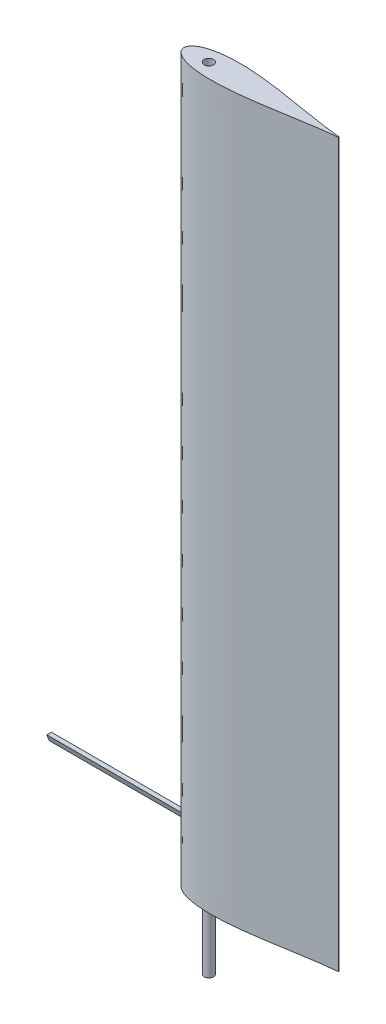
ISO-10303-21;
HEADER;
FILE_DESCRIPTION(('STEP AP214'),'2;1');
FILE_NAME('part.step','',(''),(''),'','','');
FILE_SCHEMA(('AUTOMOTIVE_DESIGN { 1 0 10303 214 1 1 1 1 }'));
ENDSEC;
DATA;
#1=APPLICATION_CONTEXT('core data for automotive mechanical design processes');
#2=APPLICATION_PROTOCOL_DEFINITION('international standard','automotive_design',2000,#1);
#3=PRODUCT_CONTEXT('',#1,'mechanical');
#4=PRODUCT('Part','Part','',(#3));
#5=PRODUCT_RELATED_PRODUCT_CATEGORY('part','',(#4));
#6=PRODUCT_DEFINITION_FORMATION('','',#4);
#7=PRODUCT_DEFINITION_CONTEXT('part definition',#1,'design');
#8=PRODUCT_DEFINITION('design','',#6,#7);
#9=PRODUCT_DEFINITION_SHAPE('','',#8);
#10=(LENGTH_UNIT() NAMED_UNIT(*) SI_UNIT(.MILLI.,.METRE.));
#11=(NAMED_UNIT(*) PLANE_ANGLE_UNIT() SI_UNIT($,.RADIAN.));
#12=(NAMED_UNIT(*) SI_UNIT($,.STERADIAN.) SOLID_ANGLE_UNIT());
#13=UNCERTAINTY_MEASURE_WITH_UNIT(LENGTH_MEASURE(1.E-05),#10,'distance_accuracy_value','');
#14=(GEOMETRIC_REPRESENTATION_CONTEXT(3) GLOBAL_UNCERTAINTY_ASSIGNED_CONTEXT((#13)) GLOBAL_UNIT_ASSIGNED_CONTEXT((#10,
#11,#12)) REPRESENTATION_CONTEXT('',''));
#15=CARTESIAN_POINT('',(0.,0.,0.));
#16=DIRECTION('',(0.,0.,1.));
#17=DIRECTION('',(1.,0.,0.));
#18=AXIS2_PLACEMENT_3D('',#15,#16,#17);
#19=CARTESIAN_POINT('',(346.734758531988,228.6,-1054.43015607607));
#20=DIRECTION('',(0.,-0.351123441588392,-0.936329177569044));
#21=DIRECTION('',(0.,0.936329177569045,-0.351123441588392));
#22=AXIS2_PLACEMENT_3D('',#19,#20,#21);
#23=PLANE('',#22);
#24=DIRECTION('',(0.,0.936329177569045,-0.351123441588392));
#25=VECTOR('',#24,1.);
#26=CARTESIAN_POINT('',(905.534758531988,228.6,-1054.43015607607));
#27=LINE('',#26,#25);
#28=CARTESIAN_POINT('',(905.534758531988,228.6,-1054.43015607607));
#29=VERTEX_POINT('',#28);
#30=CARTESIAN_POINT('',(905.534758531988,254.,-1063.95515607607));
#31=VERTEX_POINT('',#30);
#32=EDGE_CURVE('E98',#29,#31,#27,.T.);
#33=ORIENTED_EDGE('',*,*,#32,.F.);
#34=DIRECTION('',(1.,0.,0.));
#35=VECTOR('',#34,1.);
#36=CARTESIAN_POINT('',(346.734758531988,228.6,-1054.43015607607));
#37=LINE('',#36,#35);
#38=CARTESIAN_POINT('',(346.734758531988,228.6,-1054.43015607607));
#39=VERTEX_POINT('',#38);
#40=EDGE_CURVE('E12',#39,#29,#37,.T.);
#41=ORIENTED_EDGE('',*,*,#40,.F.);
#42=DIRECTION('',(0.,0.936329177569045,-0.351123441588392));
#43=VECTOR('',#42,1.);
#44=CARTESIAN_POINT('',(346.734758531988,228.6,-1054.43015607607));
#45=LINE('',#44,#43);
#46=CARTESIAN_POINT('',(346.734758531988,254.,-1063.95515607607));
#47=VERTEX_POINT('',#46);
#48=EDGE_CURVE('E90',#39,#47,#45,.T.);
#49=ORIENTED_EDGE('',*,*,#48,.T.);
#50=DIRECTION('',(1.,0.,0.));
#51=VECTOR('',#50,1.);
#52=CARTESIAN_POINT('',(346.734758531988,254.,-1063.95515607607));
#53=LINE('',#52,#51);
#54=EDGE_CURVE('E49',#47,#31,#53,.T.);
#55=ORIENTED_EDGE('',*,*,#54,.T.);
#56=EDGE_LOOP('',(#33,#41,#49,#55));
#57=FACE_BOUND('',#56,.T.);
#58=ADVANCED_FACE('F46',(#57),#23,.T.);
#59=CARTESIAN_POINT('',(346.734758531988,254.,-1044.90515607607));
#60=DIRECTION('',(0.,-0.351123441588392,0.936329177569044));
#61=DIRECTION('',(0.,-0.936329177569045,-0.351123441588392));
#62=AXIS2_PLACEMENT_3D('',#59,#60,#61);
#63=PLANE('',#62);
#64=DIRECTION('',(0.,-0.936329177569045,-0.351123441588392));
#65=VECTOR('',#64,1.);
#66=CARTESIAN_POINT('',(905.534758531988,254.,-1044.90515607607));
#67=LINE('',#66,#65);
#68=CARTESIAN_POINT('',(905.534758531988,254.,-1044.90515607607));
#69=VERTEX_POINT('',#68);
#70=EDGE_CURVE('E92',#69,#29,#67,.T.);
#71=ORIENTED_EDGE('',*,*,#70,.F.);
#72=DIRECTION('',(1.,0.,0.));
#73=VECTOR('',#72,1.);
#74=CARTESIAN_POINT('',(346.734758531988,254.,-1044.90515607607));
#75=LINE('',#74,#73);
#76=CARTESIAN_POINT('',(346.734758531988,254.,-1044.90515607607));
#77=VERTEX_POINT('',#76);
#78=EDGE_CURVE('E55',#77,#69,#75,.T.);
#79=ORIENTED_EDGE('',*,*,#78,.F.);
#80=DIRECTION('',(0.,-0.936329177569045,-0.351123441588392));
#81=VECTOR('',#80,1.);
#82=CARTESIAN_POINT('',(346.734758531988,254.,-1044.90515607607));
#83=LINE('',#82,#81);
#84=EDGE_CURVE('E87',#77,#39,#83,.T.);
#85=ORIENTED_EDGE('',*,*,#84,.T.);
#86=ORIENTED_EDGE('',*,*,#40,.T.);
#87=EDGE_LOOP('',(#71,#79,#85,#86));
#88=FACE_BOUND('',#87,.T.);
#89=ADVANCED_FACE('F102',(#88),#63,.T.);
#90=CARTESIAN_POINT('',(346.734758531988,254.,-1063.95515607607));
#91=DIRECTION('',(0.,1.,0.));
#92=DIRECTION('',(0.,0.,1.));
#93=AXIS2_PLACEMENT_3D('',#90,#91,#92);
#94=PLANE('',#93);
#95=DIRECTION('',(0.,0.,1.));
#96=VECTOR('',#95,1.);
#97=CARTESIAN_POINT('',(905.534758531988,254.,-1063.95515607607));
#98=LINE('',#97,#96);
#99=EDGE_CURVE('E85',#31,#69,#98,.T.);
#100=ORIENTED_EDGE('',*,*,#99,.F.);
#101=ORIENTED_EDGE('',*,*,#54,.F.);
#102=DIRECTION('',(0.,0.,1.));
#103=VECTOR('',#102,1.);
#104=CARTESIAN_POINT('',(346.734758531988,254.,-1063.95515607607));
#105=LINE('',#104,#103);
#106=EDGE_CURVE('E83',#47,#77,#105,.T.);
#107=ORIENTED_EDGE('',*,*,#106,.T.);
#108=ORIENTED_EDGE('',*,*,#78,.T.);
#109=EDGE_LOOP('',(#100,#101,#107,#108));
#110=FACE_BOUND('',#109,.T.);
#111=ADVANCED_FACE('F82',(#110),#94,.T.);
#112=CARTESIAN_POINT('',(346.734758531988,0.,0.));
#113=DIRECTION('',(1.,0.,0.));
#114=DIRECTION('',(0.,0.,-1.));
#115=AXIS2_PLACEMENT_3D('',#112,#113,#114);
#116=PLANE('',#115);
#117=ORIENTED_EDGE('',*,*,#48,.F.);
#118=ORIENTED_EDGE('',*,*,#84,.F.);
#119=ORIENTED_EDGE('',*,*,#106,.F.);
#120=EDGE_LOOP('',(#117,#118,#119));
#121=FACE_BOUND('',#120,.T.);
#122=ADVANCED_FACE('F89',(#121),#116,.F.);
#123=CARTESIAN_POINT('',(905.534758531987,0.,0.));
#124=DIRECTION('',(1.,0.,0.));
#125=DIRECTION('',(0.,0.,-1.));
#126=AXIS2_PLACEMENT_3D('',#123,#124,#125);
#127=PLANE('',#126);
#128=ORIENTED_EDGE('',*,*,#32,.T.);
#129=ORIENTED_EDGE('',*,*,#99,.T.);
#130=ORIENTED_EDGE('',*,*,#70,.T.);
#131=EDGE_LOOP('',(#128,#129,#130));
#132=FACE_BOUND('',#131,.T.);
#133=ADVANCED_FACE('F101',(#132),#127,.T.);
#134=CLOSED_SHELL('',(#58,#89,#111,#122,#133));
#135=MANIFOLD_SOLID_BREP('B2',#134);
#136=CARTESIAN_POINT('',(1009.6747760744,-279.4,-1054.43015598688));
#137=DIRECTION('',(0.,1.,0.));
#138=DIRECTION('',(0.,0.,1.));
#139=AXIS2_PLACEMENT_3D('',#136,#137,#138);
#140=CYLINDRICAL_SURFACE('',#139,19.05);
#141=CARTESIAN_POINT('',(1009.6747760744,-279.4,-1054.43015598688));
#142=DIRECTION('',(0.,-1.,0.));
#143=DIRECTION('',(0.,0.,-1.));
#144=AXIS2_PLACEMENT_3D('',#141,#142,#143);
#145=CIRCLE('',#144,19.05);
#146=CARTESIAN_POINT('',(1009.6747760744,-279.4,-1073.48015598688));
#147=VERTEX_POINT('',#146);
#148=EDGE_CURVE('E45',#147,#147,#145,.T.);
#149=ORIENTED_EDGE('',*,*,#148,.F.);
#150=EDGE_LOOP('',(#149));
#151=FACE_BOUND('',#150,.T.);
#152=CARTESIAN_POINT('',(1009.6747760744,0.,-1054.43015598688));
#153=DIRECTION('',(0.,-1.,0.));
#154=DIRECTION('',(0.,0.,-1.));
#155=AXIS2_PLACEMENT_3D('',#152,#153,#154);
#156=CIRCLE('',#155,19.05);
#157=CARTESIAN_POINT('',(1009.6747760744,0.,-1073.48015598688));
#158=VERTEX_POINT('',#157);
#159=EDGE_CURVE('E156',#158,#158,#156,.T.);
#160=ORIENTED_EDGE('',*,*,#159,.T.);
#161=EDGE_LOOP('',(#160));
#162=FACE_BOUND('',#161,.T.);
#163=ADVANCED_FACE('F153',(#151,#162),#140,.T.);
#164=CARTESIAN_POINT('',(1009.6747760744,-279.4,-1054.43015598688));
#165=DIRECTION('',(0.,-1.,0.));
#166=DIRECTION('',(0.,0.,-1.));
#167=AXIS2_PLACEMENT_3D('',#164,#165,#166);
#168=PLANE('',#167);
#169=ORIENTED_EDGE('',*,*,#148,.T.);
#170=EDGE_LOOP('',(#169));
#171=FACE_BOUND('',#170,.T.);
#172=ADVANCED_FACE('F168',(#171),#168,.T.);
#173=CARTESIAN_POINT('',(1009.6747760744,0.,-1054.43015598688));
#174=DIRECTION('',(0.,-1.,0.));
#175=DIRECTION('',(0.,0.,-1.));
#176=AXIS2_PLACEMENT_3D('',#173,#174,#175);
#177=PLANE('',#176);
#178=ORIENTED_EDGE('',*,*,#159,.F.);
#179=EDGE_LOOP('',(#178));
#180=FACE_BOUND('',#179,.T.);
#181=ADVANCED_FACE('F166',(#180),#177,.F.);
#182=CLOSED_SHELL('',(#163,#172,#181));
#183=MANIFOLD_SOLID_BREP('B6',#182);
#184=CARTESIAN_POINT('',(1547.91406360688,2997.2,-1054.43015584343));
#185=DIRECTION('',(0.,-1.,0.));
#186=DIRECTION('',(0.,0.,-1.));
#187=AXIS2_PLACEMENT_3D('',#184,#185,#186);
#188=CYLINDRICAL_SURFACE('',#187,1.58749985704333);
#189=CARTESIAN_POINT('',(1547.91406360688,0.,-1054.43015584343));
#190=DIRECTION('',(0.,1.,0.));
#191=DIRECTION('',(0.,0.,1.));
#192=AXIS2_PLACEMENT_3D('',#189,#190,#191);
#193=CIRCLE('',#192,1.58749985704333);
#194=CARTESIAN_POINT('',(1548.04562536815,0.,-1052.84811687454));
#195=VERTEX_POINT('',#194);
#196=CARTESIAN_POINT('',(1548.04562714094,0.,-1056.01219466489));
#197=VERTEX_POINT('',#196);
#198=EDGE_CURVE('E243',#195,#197,#193,.T.);
#199=ORIENTED_EDGE('',*,*,#198,.T.);
#200=DIRECTION('',(0.,-1.,0.));
#201=VECTOR('',#200,1.);
#202=CARTESIAN_POINT('',(1548.04562714094,2997.2,-1056.01219466489));
#203=LINE('',#202,#201);
#204=CARTESIAN_POINT('',(1548.04562714094,2997.2,-1056.01219466489));
#205=VERTEX_POINT('',#204);
#206=EDGE_CURVE('E151',#205,#197,#203,.T.);
#207=ORIENTED_EDGE('',*,*,#206,.F.);
#208=CARTESIAN_POINT('',(1547.91406360688,2997.2,-1054.43015584343));
#209=DIRECTION('',(0.,1.,0.));
#210=DIRECTION('',(0.,0.,1.));
#211=AXIS2_PLACEMENT_3D('',#208,#209,#210);
#212=CIRCLE('',#211,1.58749985704333);
#213=CARTESIAN_POINT('',(1548.04562536815,2997.2,-1052.84811687454));
#214=VERTEX_POINT('',#213);
#215=EDGE_CURVE('E235',#214,#205,#212,.T.);
#216=ORIENTED_EDGE('',*,*,#215,.F.);
#217=DIRECTION('',(0.,-1.,0.));
#218=VECTOR('',#217,1.);
#219=CARTESIAN_POINT('',(1548.04562536815,2997.2,-1052.84811687454));
#220=LINE('',#219,#218);
#221=EDGE_CURVE('E244',#214,#195,#220,.T.);
#222=ORIENTED_EDGE('',*,*,#221,.T.);
#223=EDGE_LOOP('',(#199,#207,#216,#222));
#224=FACE_BOUND('',#223,.T.);
#225=ADVANCED_FACE('F194',(#224),#188,.T.);
#226=CARTESIAN_POINT('',(1548.04562714094,2997.2,-1056.01219466489));
#227=CARTESIAN_POINT('',(1542.90979132297,2997.2,-1056.47251901338));
#228=CARTESIAN_POINT('',(1530.54090969649,2997.2,-1057.58114039031));
#229=CARTESIAN_POINT('',(1510.98655603857,2997.2,-1059.8162134121));
#230=CARTESIAN_POINT('',(1482.17788458853,2997.2,-1063.52677690204));
#231=CARTESIAN_POINT('',(1446.25715296503,2997.2,-1068.8300948122));
#232=CARTESIAN_POINT('',(1403.24224431028,2997.2,-1075.75708103397));
#233=CARTESIAN_POINT('',(1360.26655873229,2997.2,-1082.92357882811));
#234=CARTESIAN_POINT('',(1317.28233617057,2997.2,-1090.03880075185));
#235=CARTESIAN_POINT('',(1274.24574534359,2997.2,-1096.83310990156));
#236=CARTESIAN_POINT('',(1235.90971734576,2997.2,-1102.34329629596));
#237=CARTESIAN_POINT('',(1202.28801932789,2997.2,-1106.58475046001));
#238=CARTESIAN_POINT('',(1173.41033580507,2997.2,-1109.72262821302));
#239=CARTESIAN_POINT('',(1144.47215259423,2997.2,-1112.25028369646));
#240=CARTESIAN_POINT('',(1115.47753831224,2997.2,-1114.03555282312));
#241=CARTESIAN_POINT('',(1086.44028590363,2997.2,-1114.91850176021));
#242=CARTESIAN_POINT('',(1061.25992202755,2997.2,-1114.72795040521));
#243=CARTESIAN_POINT('',(1039.97858758653,2997.2,-1113.76102596615));
#244=CARTESIAN_POINT('',(1022.60049584414,2997.2,-1112.39857113579));
#245=CARTESIAN_POINT('',(1005.28616565011,2997.2,-1110.36938730275));
#246=CARTESIAN_POINT('',(988.08144965361,2997.2,-1107.54873899364));
#247=CARTESIAN_POINT('',(973.183943904739,2997.2,-1104.23988710413));
#248=CARTESIAN_POINT('',(960.605062366473,2997.2,-1100.66858398709));
#249=CARTESIAN_POINT('',(950.293736789123,2997.2,-1097.1358283496));
#250=CARTESIAN_POINT('',(940.233035206839,2997.2,-1092.93560049608));
#251=CARTESIAN_POINT('',(931.622325067644,2997.2,-1088.46989853447));
#252=CARTESIAN_POINT('',(924.483129486851,2997.2,-1083.88800039606));
#253=CARTESIAN_POINT('',(918.748261754732,2997.2,-1079.40834884503));
#254=CARTESIAN_POINT('',(914.008545212835,2997.2,-1074.70033943091));
#255=CARTESIAN_POINT('',(910.322770866953,2997.2,-1069.8712421104));
#256=CARTESIAN_POINT('',(907.699650062331,2997.2,-1065.07833008746));
#257=CARTESIAN_POINT('',(905.889335523857,2997.2,-1059.88211676229));
#258=CARTESIAN_POINT('',(905.652910053829,2997.2,-1056.24684883072));
#259=CARTESIAN_POINT('',(905.534758531988,2997.2,-1054.43015607607));
#260=B_SPLINE_CURVE_WITH_KNOTS('',3,(#226,#227,#228,#229,#230,#231,#232,#233,#234,#235,#236,
#237,#238,#239,#240,#241,#242,#243,#244,#245,#246,#247,#248,#249,#250,#251,#252,#253,#254,#255,
#256,#257,#258,#259),.UNSPECIFIED.,.F.,.F.,(4,1,1,1,1,1,1,1,1,1,1,1,1,1,1,1,1,1,1,1,1,1,1,1,1,1,
1,1,1,1,1,4),(0.,0.023121882902336,0.0556855481244279,0.0882476640900179,0.153371090022843,
0.218495160317918,0.283619422715733,0.348743654926282,0.413867682218255,0.478991362615527,
0.522407388689091,0.565823311466184,0.609239114713232,0.652654646994898,0.69606981916018,
0.739484349349418,0.765534360053334,0.79158424933037,0.817634086883741,0.843683680569561,
0.869732753159873,0.886015096655172,0.902297611598798,0.918580439847692,0.934862883284266,
0.945721090491168,0.956578978301599,0.96743702362953,0.975584776528351,0.983729340323516,
0.991868882815751,1.),.UNSPECIFIED.);
#261=DIRECTION('',(0.,-1.,0.));
#262=VECTOR('',#261,1.);
#263=SURFACE_OF_LINEAR_EXTRUSION('',#260,#262);
#264=CARTESIAN_POINT('',(1548.04562714094,0.,-1056.01219466489));
#265=CARTESIAN_POINT('',(1542.90979132297,0.,-1056.47251901338));
#266=CARTESIAN_POINT('',(1530.54090969649,0.,-1057.58114039031));
#267=CARTESIAN_POINT('',(1510.98655603857,0.,-1059.8162134121));
#268=CARTESIAN_POINT('',(1482.17788458853,0.,-1063.52677690204));
#269=CARTESIAN_POINT('',(1446.25715296503,0.,-1068.8300948122));
#270=CARTESIAN_POINT('',(1403.24224431028,0.,-1075.75708103397));
#271=CARTESIAN_POINT('',(1360.26655873229,0.,-1082.92357882811));
#272=CARTESIAN_POINT('',(1317.28233617057,0.,-1090.03880075185));
#273=CARTESIAN_POINT('',(1274.24574534359,0.,-1096.83310990156));
#274=CARTESIAN_POINT('',(1235.90971734576,0.,-1102.34329629596));
#275=CARTESIAN_POINT('',(1202.28801932789,0.,-1106.58475046001));
#276=CARTESIAN_POINT('',(1173.41033580507,0.,-1109.72262821302));
#277=CARTESIAN_POINT('',(1144.47215259423,0.,-1112.25028369646));
#278=CARTESIAN_POINT('',(1115.47753831224,0.,-1114.03555282312));
#279=CARTESIAN_POINT('',(1086.44028590363,0.,-1114.91850176021));
#280=CARTESIAN_POINT('',(1061.25992202755,0.,-1114.72795040521));
#281=CARTESIAN_POINT('',(1039.97858758653,0.,-1113.76102596615));
#282=CARTESIAN_POINT('',(1022.60049584414,0.,-1112.39857113579));
#283=CARTESIAN_POINT('',(1005.28616565011,0.,-1110.36938730275));
#284=CARTESIAN_POINT('',(988.08144965361,0.,-1107.54873899364));
#285=CARTESIAN_POINT('',(973.183943904739,0.,-1104.23988710413));
#286=CARTESIAN_POINT('',(960.605062366473,0.,-1100.66858398709));
#287=CARTESIAN_POINT('',(950.293736789123,0.,-1097.1358283496));
#288=CARTESIAN_POINT('',(940.233035206839,0.,-1092.93560049608));
#289=CARTESIAN_POINT('',(931.622325067644,0.,-1088.46989853447));
#290=CARTESIAN_POINT('',(924.483129486851,0.,-1083.88800039606));
#291=CARTESIAN_POINT('',(918.748261754732,0.,-1079.40834884503));
#292=CARTESIAN_POINT('',(914.008545212835,0.,-1074.70033943091));
#293=CARTESIAN_POINT('',(910.322770866953,0.,-1069.8712421104));
#294=CARTESIAN_POINT('',(907.699650062331,0.,-1065.07833008746));
#295=CARTESIAN_POINT('',(905.889335523857,0.,-1059.88211676229));
#296=CARTESIAN_POINT('',(905.652910053829,0.,-1056.24684883072));
#297=CARTESIAN_POINT('',(905.534758531988,0.,-1054.43015607607));
#298=B_SPLINE_CURVE_WITH_KNOTS('',3,(#264,#265,#266,#267,#268,#269,#270,#271,#272,#273,#274,
#275,#276,#277,#278,#279,#280,#281,#282,#283,#284,#285,#286,#287,#288,#289,#290,#291,#292,#293,
#294,#295,#296,#297),.UNSPECIFIED.,.F.,.F.,(4,1,1,1,1,1,1,1,1,1,1,1,1,1,1,1,1,1,1,1,1,1,1,1,1,1,
1,1,1,1,1,4),(0.,0.023121882902336,0.0556855481244279,0.0882476640900179,0.153371090022843,
0.218495160317918,0.283619422715733,0.348743654926282,0.413867682218255,0.478991362615527,
0.522407388689091,0.565823311466184,0.609239114713232,0.652654646994898,0.69606981916018,
0.739484349349418,0.765534360053334,0.79158424933037,0.817634086883741,0.843683680569561,
0.869732753159873,0.886015096655172,0.902297611598798,0.918580439847692,0.934862883284266,
0.945721090491168,0.956578978301599,0.96743702362953,0.975584776528351,0.983729340323516,
0.991868882815751,1.),.UNSPECIFIED.);
#299=CARTESIAN_POINT('',(905.534758531988,0.,-1054.43015607607));
#300=VERTEX_POINT('',#299);
#301=EDGE_CURVE('E223',#197,#300,#298,.T.);
#302=ORIENTED_EDGE('',*,*,#301,.T.);
#303=DIRECTION('',(0.,-1.,0.));
#304=VECTOR('',#303,1.);
#305=CARTESIAN_POINT('',(905.534758531988,2997.2,-1054.43015607607));
#306=LINE('',#305,#304);
#307=CARTESIAN_POINT('',(905.534758531988,2997.2,-1054.43015607607));
#308=VERTEX_POINT('',#307);
#309=EDGE_CURVE('E203',#308,#300,#306,.T.);
#310=ORIENTED_EDGE('',*,*,#309,.F.);
#311=EDGE_CURVE('E231',#205,#308,#260,.T.);
#312=ORIENTED_EDGE('',*,*,#311,.F.);
#313=ORIENTED_EDGE('',*,*,#206,.T.);
#314=EDGE_LOOP('',(#302,#310,#312,#313));
#315=FACE_BOUND('',#314,.T.);
#316=ADVANCED_FACE('F232',(#315),#263,.F.);
#317=CARTESIAN_POINT('',(1009.6747760744,2997.2,-1054.43015598688));
#318=DIRECTION('',(0.,-1.,0.));
#319=DIRECTION('',(0.,0.,-1.));
#320=AXIS2_PLACEMENT_3D('',#317,#318,#319);
#321=CYLINDRICAL_SURFACE('',#320,19.4310000000003);
#322=CARTESIAN_POINT('',(1009.6747760744,2997.2,-1054.43015598688));
#323=DIRECTION('',(0.,1.,0.));
#324=DIRECTION('',(0.,0.,1.));
#325=AXIS2_PLACEMENT_3D('',#322,#323,#324);
#326=CIRCLE('',#325,19.4310000000003);
#327=CARTESIAN_POINT('',(1009.6747760744,2997.2,-1034.99915598688));
#328=VERTEX_POINT('',#327);
#329=EDGE_CURVE('E240',#328,#328,#326,.T.);
#330=ORIENTED_EDGE('',*,*,#329,.T.);
#331=EDGE_LOOP('',(#330));
#332=FACE_BOUND('',#331,.T.);
#333=CARTESIAN_POINT('',(1009.6747760744,0.,-1054.43015598688));
#334=DIRECTION('',(0.,1.,0.));
#335=DIRECTION('',(0.,0.,1.));
#336=AXIS2_PLACEMENT_3D('',#333,#334,#335);
#337=CIRCLE('',#336,19.4310000000003);
#338=CARTESIAN_POINT('',(1009.6747760744,0.,-1034.99915598688));
#339=VERTEX_POINT('',#338);
#340=EDGE_CURVE('E246',#339,#339,#337,.T.);
#341=ORIENTED_EDGE('',*,*,#340,.F.);
#342=EDGE_LOOP('',(#341));
#343=FACE_BOUND('',#342,.T.);
#344=ADVANCED_FACE('F196',(#332,#343),#321,.F.);
#345=CARTESIAN_POINT('',(905.534758531988,2997.2,-1054.43015607607));
#346=CARTESIAN_POINT('',(905.65291003917,2997.2,-1052.61346301532));
#347=CARTESIAN_POINT('',(905.889335459738,2997.2,-1048.97819478071));
#348=CARTESIAN_POINT('',(907.699649806882,2997.2,-1043.78198126173));
#349=CARTESIAN_POINT('',(910.322771314141,2997.2,-1038.98906984997));
#350=CARTESIAN_POINT('',(914.00854454302,2997.2,-1034.15997221752));
#351=CARTESIAN_POINT('',(918.748262950897,2997.2,-1029.45196450605));
#352=CARTESIAN_POINT('',(924.4831285427,2997.2,-1024.97231055156));
#353=CARTESIAN_POINT('',(931.622325101701,2997.2,-1020.39041368908));
#354=CARTESIAN_POINT('',(940.23303661244,2997.2,-1015.92471487721));
#355=CARTESIAN_POINT('',(950.293735449032,2997.2,-1011.72448045397));
#356=CARTESIAN_POINT('',(960.605062584542,2997.2,-1008.19172855489));
#357=CARTESIAN_POINT('',(973.183944170162,2997.2,-1004.62042722673));
#358=CARTESIAN_POINT('',(988.081450073409,2997.2,-1001.31157647305));
#359=CARTESIAN_POINT('',(1005.28616494035,2997.2,-998.490920501776));
#360=CARTESIAN_POINT('',(1022.60049618902,2997.2,-996.461744206485));
#361=CARTESIAN_POINT('',(1039.97858764475,2997.2,-995.099288885668));
#362=CARTESIAN_POINT('',(1061.25992189294,2997.2,-994.13235766857));
#363=CARTESIAN_POINT('',(1086.44028589908,2997.2,-993.941809689974));
#364=CARTESIAN_POINT('',(1115.47753849412,2997.2,-994.824755561533));
#365=CARTESIAN_POINT('',(1144.47215221503,2997.2,-996.610033064738));
#366=CARTESIAN_POINT('',(1173.41033604911,2997.2,-999.137680365465));
#367=CARTESIAN_POINT('',(1202.28801929559,2997.2,-1002.27556025907));
#368=CARTESIAN_POINT('',(1235.90971734142,2997.2,-1006.51701392688));
#369=CARTESIAN_POINT('',(1274.24574554974,2997.2,-1012.02719972549));
#370=CARTESIAN_POINT('',(1317.28233588563,2997.2,-1018.82151225547));
#371=CARTESIAN_POINT('',(1360.2665587479,2997.2,-1025.93673227961));
#372=CARTESIAN_POINT('',(1403.24224450232,2997.2,-1033.10322884786));
#373=CARTESIAN_POINT('',(1446.25715297965,2997.2,-1040.03021642064));
#374=CARTESIAN_POINT('',(1482.17788430055,2997.2,-1045.33353713133));
#375=CARTESIAN_POINT('',(1510.98655624174,2997.2,-1049.04409689201));
#376=CARTESIAN_POINT('',(1530.54090956592,2997.2,-1051.27917240841));
#377=CARTESIAN_POINT('',(1542.90979130659,2997.2,-1052.38779267236));
#378=CARTESIAN_POINT('',(1548.04562536815,2997.2,-1052.84811687454));
#379=B_SPLINE_CURVE_WITH_KNOTS('',3,(#345,#346,#347,#348,#349,#350,#351,#352,#353,#354,#355,
#356,#357,#358,#359,#360,#361,#362,#363,#364,#365,#366,#367,#368,#369,#370,#371,#372,#373,#374,
#375,#376,#377,#378),.UNSPECIFIED.,.F.,.F.,(4,1,1,1,1,1,1,1,1,1,1,1,1,1,1,1,1,1,1,1,1,1,1,1,1,1,
1,1,1,1,1,4),(0.,0.008131118567574,0.0162706610594546,0.0244152237460296,0.0325629770959686,
0.0434210209426281,0.0542789104761411,0.0651371169270016,0.0814195590697053,0.0977023894781959,
0.113984903513466,0.130267246243737,0.156316318832912,0.182365913427851,0.208415750325098,
0.234465639600998,0.260515650560648,0.303930180747992,0.34734535291138,0.390760885528295,
0.434176688293101,0.477592611068301,0.52100863713997,0.586132317534402,0.651256345254785,
0.71638057723659,0.781504839404135,0.846628909998324,0.91175233615406,0.944314451852162,
0.976878117227631,1.),.UNSPECIFIED.);
#380=DIRECTION('',(0.,-1.,0.));
#381=VECTOR('',#380,1.);
#382=SURFACE_OF_LINEAR_EXTRUSION('',#379,#381);
#383=CARTESIAN_POINT('',(905.534758531988,0.,-1054.43015607607));
#384=CARTESIAN_POINT('',(905.65291003917,0.,-1052.61346301532));
#385=CARTESIAN_POINT('',(905.889335459738,0.,-1048.97819478071));
#386=CARTESIAN_POINT('',(907.699649806882,0.,-1043.78198126173));
#387=CARTESIAN_POINT('',(910.322771314141,0.,-1038.98906984997));
#388=CARTESIAN_POINT('',(914.00854454302,0.,-1034.15997221752));
#389=CARTESIAN_POINT('',(918.748262950897,0.,-1029.45196450605));
#390=CARTESIAN_POINT('',(924.4831285427,0.,-1024.97231055156));
#391=CARTESIAN_POINT('',(931.622325101701,0.,-1020.39041368908));
#392=CARTESIAN_POINT('',(940.23303661244,0.,-1015.92471487721));
#393=CARTESIAN_POINT('',(950.293735449032,0.,-1011.72448045397));
#394=CARTESIAN_POINT('',(960.605062584542,0.,-1008.19172855489));
#395=CARTESIAN_POINT('',(973.183944170162,0.,-1004.62042722673));
#396=CARTESIAN_POINT('',(988.081450073409,0.,-1001.31157647305));
#397=CARTESIAN_POINT('',(1005.28616494035,0.,-998.490920501776));
#398=CARTESIAN_POINT('',(1022.60049618902,0.,-996.461744206485));
#399=CARTESIAN_POINT('',(1039.97858764475,0.,-995.099288885668));
#400=CARTESIAN_POINT('',(1061.25992189294,0.,-994.13235766857));
#401=CARTESIAN_POINT('',(1086.44028589908,0.,-993.941809689974));
#402=CARTESIAN_POINT('',(1115.47753849412,0.,-994.824755561533));
#403=CARTESIAN_POINT('',(1144.47215221503,0.,-996.610033064738));
#404=CARTESIAN_POINT('',(1173.41033604911,0.,-999.137680365465));
#405=CARTESIAN_POINT('',(1202.28801929559,0.,-1002.27556025907));
#406=CARTESIAN_POINT('',(1235.90971734142,0.,-1006.51701392688));
#407=CARTESIAN_POINT('',(1274.24574554974,0.,-1012.02719972549));
#408=CARTESIAN_POINT('',(1317.28233588563,0.,-1018.82151225547));
#409=CARTESIAN_POINT('',(1360.2665587479,0.,-1025.93673227961));
#410=CARTESIAN_POINT('',(1403.24224450232,0.,-1033.10322884786));
#411=CARTESIAN_POINT('',(1446.25715297965,0.,-1040.03021642064));
#412=CARTESIAN_POINT('',(1482.17788430055,0.,-1045.33353713133));
#413=CARTESIAN_POINT('',(1510.98655624174,0.,-1049.04409689201));
#414=CARTESIAN_POINT('',(1530.54090956592,0.,-1051.27917240841));
#415=CARTESIAN_POINT('',(1542.90979130659,0.,-1052.38779267236));
#416=CARTESIAN_POINT('',(1548.04562536815,0.,-1052.84811687454));
#417=B_SPLINE_CURVE_WITH_KNOTS('',3,(#383,#384,#385,#386,#387,#388,#389,#390,#391,#392,#393,
#394,#395,#396,#397,#398,#399,#400,#401,#402,#403,#404,#405,#406,#407,#408,#409,#410,#411,#412,
#413,#414,#415,#416),.UNSPECIFIED.,.F.,.F.,(4,1,1,1,1,1,1,1,1,1,1,1,1,1,1,1,1,1,1,1,1,1,1,1,1,1,
1,1,1,1,1,4),(0.,0.008131118567574,0.0162706610594546,0.0244152237460296,0.0325629770959686,
0.0434210209426281,0.0542789104761411,0.0651371169270016,0.0814195590697053,0.0977023894781959,
0.113984903513466,0.130267246243737,0.156316318832912,0.182365913427851,0.208415750325098,
0.234465639600998,0.260515650560648,0.303930180747992,0.34734535291138,0.390760885528295,
0.434176688293101,0.477592611068301,0.52100863713997,0.586132317534402,0.651256345254785,
0.71638057723659,0.781504839404135,0.846628909998324,0.91175233615406,0.944314451852162,
0.976878117227631,1.),.UNSPECIFIED.);
#418=EDGE_CURVE('E228',#300,#195,#417,.T.);
#419=ORIENTED_EDGE('',*,*,#418,.T.);
#420=ORIENTED_EDGE('',*,*,#221,.F.);
#421=EDGE_CURVE('E211',#308,#214,#379,.T.);
#422=ORIENTED_EDGE('',*,*,#421,.F.);
#423=ORIENTED_EDGE('',*,*,#309,.T.);
#424=EDGE_LOOP('',(#419,#420,#422,#423));
#425=FACE_BOUND('',#424,.T.);
#426=ADVANCED_FACE('F264',(#425),#382,.F.);
#427=CARTESIAN_POINT('',(0.,2997.2,0.));
#428=DIRECTION('',(0.,1.,0.));
#429=DIRECTION('',(0.,0.,1.));
#430=AXIS2_PLACEMENT_3D('',#427,#428,#429);
#431=PLANE('',#430);
#432=ORIENTED_EDGE('',*,*,#329,.F.);
#433=EDGE_LOOP('',(#432));
#434=FACE_BOUND('',#433,.T.);
#435=ORIENTED_EDGE('',*,*,#215,.T.);
#436=ORIENTED_EDGE('',*,*,#311,.T.);
#437=ORIENTED_EDGE('',*,*,#421,.T.);
#438=EDGE_LOOP('',(#435,#436,#437));
#439=FACE_BOUND('',#438,.T.);
#440=ADVANCED_FACE('F238',(#434,#439),#431,.T.);
#441=CARTESIAN_POINT('',(0.,0.,0.));
#442=DIRECTION('',(0.,1.,0.));
#443=DIRECTION('',(0.,0.,1.));
#444=AXIS2_PLACEMENT_3D('',#441,#442,#443);
#445=PLANE('',#444);
#446=ORIENTED_EDGE('',*,*,#340,.T.);
#447=EDGE_LOOP('',(#446));
#448=FACE_BOUND('',#447,.T.);
#449=ORIENTED_EDGE('',*,*,#198,.F.);
#450=ORIENTED_EDGE('',*,*,#418,.F.);
#451=ORIENTED_EDGE('',*,*,#301,.F.);
#452=EDGE_LOOP('',(#449,#450,#451));
#453=FACE_BOUND('',#452,.T.);
#454=ADVANCED_FACE('F265',(#448,#453),#445,.F.);
#455=CLOSED_SHELL('',(#225,#316,#344,#426,#440,#454));
#456=MANIFOLD_SOLID_BREP('B40',#455);
#457=ADVANCED_BREP_SHAPE_REPRESENTATION('',(#18,#135,#183,#456),#14);
#458=SHAPE_DEFINITION_REPRESENTATION(#9,#457);
ENDSEC;
END-ISO-10303-21;
